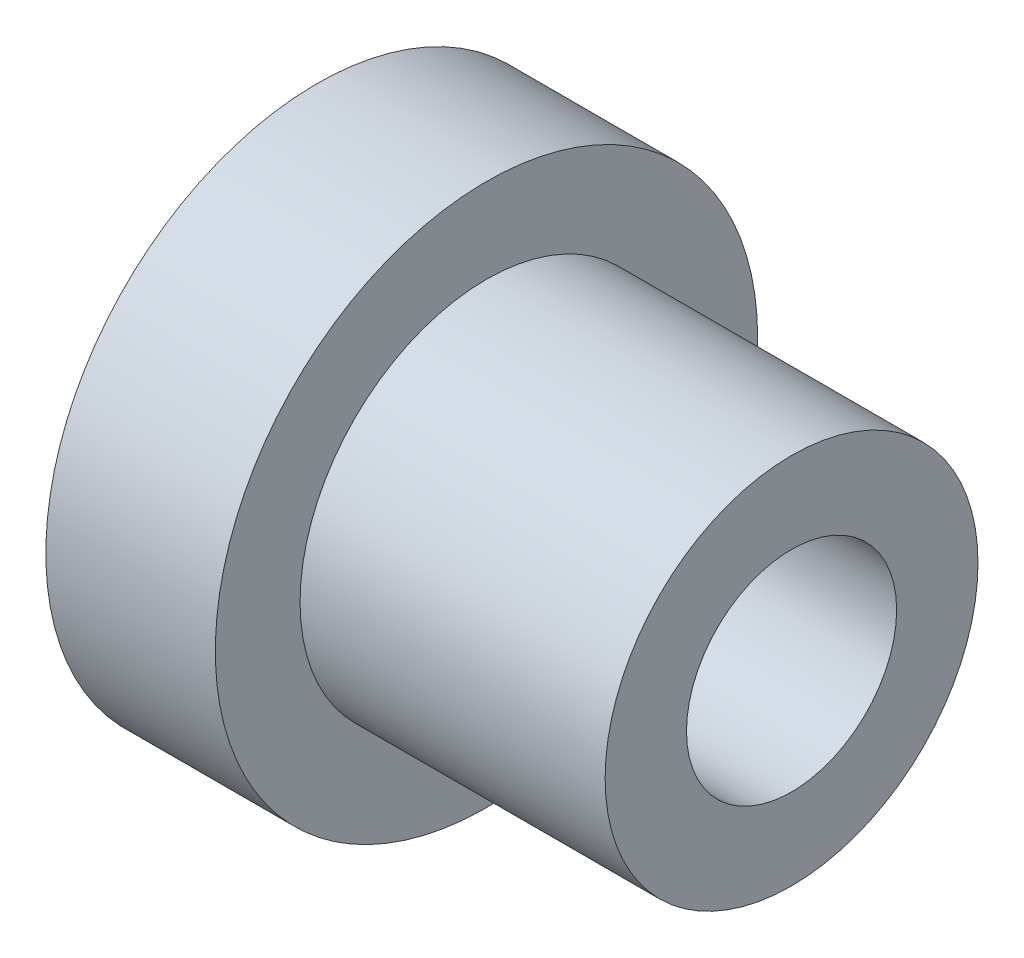
ISO-10303-21;
HEADER;
FILE_DESCRIPTION(('STEP AP214'),'2;1');
FILE_NAME('part.step','',(''),(''),'','','');
FILE_SCHEMA(('AUTOMOTIVE_DESIGN { 1 0 10303 214 1 1 1 1 }'));
ENDSEC;
DATA;
#1=APPLICATION_CONTEXT('core data for automotive mechanical design processes');
#2=APPLICATION_PROTOCOL_DEFINITION('international standard','automotive_design',2000,#1);
#3=PRODUCT_CONTEXT('',#1,'mechanical');
#4=PRODUCT('Part','Part','',(#3));
#5=PRODUCT_RELATED_PRODUCT_CATEGORY('part','',(#4));
#6=PRODUCT_DEFINITION_FORMATION('','',#4);
#7=PRODUCT_DEFINITION_CONTEXT('part definition',#1,'design');
#8=PRODUCT_DEFINITION('design','',#6,#7);
#9=PRODUCT_DEFINITION_SHAPE('','',#8);
#10=(LENGTH_UNIT() NAMED_UNIT(*) SI_UNIT(.MILLI.,.METRE.));
#11=(NAMED_UNIT(*) PLANE_ANGLE_UNIT() SI_UNIT($,.RADIAN.));
#12=(NAMED_UNIT(*) SI_UNIT($,.STERADIAN.) SOLID_ANGLE_UNIT());
#13=UNCERTAINTY_MEASURE_WITH_UNIT(LENGTH_MEASURE(1.E-05),#10,'distance_accuracy_value','');
#14=(GEOMETRIC_REPRESENTATION_CONTEXT(3) GLOBAL_UNCERTAINTY_ASSIGNED_CONTEXT((#13)) GLOBAL_UNIT_ASSIGNED_CONTEXT((#10,
#11,#12)) REPRESENTATION_CONTEXT('',''));
#15=CARTESIAN_POINT('',(0.,0.,0.));
#16=DIRECTION('',(0.,0.,1.));
#17=DIRECTION('',(1.,0.,0.));
#18=AXIS2_PLACEMENT_3D('',#15,#16,#17);
#19=CARTESIAN_POINT('',(-7.85,0.,0.));
#20=DIRECTION('',(1.,0.,0.));
#21=DIRECTION('',(0.,0.,-1.));
#22=AXIS2_PLACEMENT_3D('',#19,#20,#21);
#23=CYLINDRICAL_SURFACE('',#22,5.5);
#24=CARTESIAN_POINT('',(-2.85,0.,0.));
#25=DIRECTION('',(1.,0.,0.));
#26=DIRECTION('',(0.,0.,-1.));
#27=AXIS2_PLACEMENT_3D('',#24,#25,#26);
#28=CIRCLE('',#27,5.5);
#29=CARTESIAN_POINT('',(-2.85,0.,-5.5));
#30=VERTEX_POINT('',#29);
#31=EDGE_CURVE('E58',#30,#30,#28,.T.);
#32=ORIENTED_EDGE('',*,*,#31,.T.);
#33=EDGE_LOOP('',(#32));
#34=FACE_BOUND('',#33,.T.);
#35=CARTESIAN_POINT('',(6.15,0.,0.));
#36=DIRECTION('',(1.,0.,0.));
#37=DIRECTION('',(0.,0.,-1.));
#38=AXIS2_PLACEMENT_3D('',#35,#36,#37);
#39=CIRCLE('',#38,5.5);
#40=CARTESIAN_POINT('',(6.15,0.,-5.5));
#41=VERTEX_POINT('',#40);
#42=EDGE_CURVE('E10',#41,#41,#39,.T.);
#43=ORIENTED_EDGE('',*,*,#42,.F.);
#44=EDGE_LOOP('',(#43));
#45=FACE_BOUND('',#44,.T.);
#46=ADVANCED_FACE('F30',(#34,#45),#23,.T.);
#47=CARTESIAN_POINT('',(6.15,3.1,0.));
#48=DIRECTION('',(1.,0.,0.));
#49=DIRECTION('',(0.,0.,-1.));
#50=AXIS2_PLACEMENT_3D('',#47,#48,#49);
#51=PLANE('',#50);
#52=ORIENTED_EDGE('',*,*,#42,.T.);
#53=EDGE_LOOP('',(#52));
#54=FACE_BOUND('',#53,.T.);
#55=CARTESIAN_POINT('',(6.15,0.,0.));
#56=DIRECTION('',(1.,0.,0.));
#57=DIRECTION('',(0.,0.,-1.));
#58=AXIS2_PLACEMENT_3D('',#55,#56,#57);
#59=CIRCLE('',#58,3.1);
#60=CARTESIAN_POINT('',(6.15,0.,-3.1));
#61=VERTEX_POINT('',#60);
#62=EDGE_CURVE('E36',#61,#61,#59,.T.);
#63=ORIENTED_EDGE('',*,*,#62,.F.);
#64=EDGE_LOOP('',(#63));
#65=FACE_BOUND('',#64,.T.);
#66=ADVANCED_FACE('F76',(#54,#65),#51,.T.);
#67=CARTESIAN_POINT('',(-7.85,0.,0.));
#68=DIRECTION('',(1.,0.,0.));
#69=DIRECTION('',(0.,0.,-1.));
#70=AXIS2_PLACEMENT_3D('',#67,#68,#69);
#71=CYLINDRICAL_SURFACE('',#70,3.1);
#72=ORIENTED_EDGE('',*,*,#62,.T.);
#73=EDGE_LOOP('',(#72));
#74=FACE_BOUND('',#73,.T.);
#75=CARTESIAN_POINT('',(-5.35,0.,0.));
#76=DIRECTION('',(1.,0.,0.));
#77=DIRECTION('',(0.,0.,-1.));
#78=AXIS2_PLACEMENT_3D('',#75,#76,#77);
#79=CIRCLE('',#78,3.1);
#80=CARTESIAN_POINT('',(-5.35,0.,-3.1));
#81=VERTEX_POINT('',#80);
#82=EDGE_CURVE('E40',#81,#81,#79,.T.);
#83=ORIENTED_EDGE('',*,*,#82,.F.);
#84=EDGE_LOOP('',(#83));
#85=FACE_BOUND('',#84,.T.);
#86=ADVANCED_FACE('F80',(#74,#85),#71,.F.);
#87=CARTESIAN_POINT('',(-5.35,6.,0.));
#88=DIRECTION('',(-1.,0.,0.));
#89=DIRECTION('',(0.,0.,1.));
#90=AXIS2_PLACEMENT_3D('',#87,#88,#89);
#91=PLANE('',#90);
#92=ORIENTED_EDGE('',*,*,#82,.T.);
#93=EDGE_LOOP('',(#92));
#94=FACE_BOUND('',#93,.T.);
#95=CARTESIAN_POINT('',(-5.35,0.,0.));
#96=DIRECTION('',(1.,0.,0.));
#97=DIRECTION('',(0.,0.,-1.));
#98=AXIS2_PLACEMENT_3D('',#95,#96,#97);
#99=CIRCLE('',#98,6.);
#100=CARTESIAN_POINT('',(-5.35,0.,-6.));
#101=VERTEX_POINT('',#100);
#102=EDGE_CURVE('E44',#101,#101,#99,.T.);
#103=ORIENTED_EDGE('',*,*,#102,.F.);
#104=EDGE_LOOP('',(#103));
#105=FACE_BOUND('',#104,.T.);
#106=ADVANCED_FACE('F84',(#94,#105),#91,.T.);
#107=CARTESIAN_POINT('',(-7.85,0.,0.));
#108=DIRECTION('',(1.,0.,0.));
#109=DIRECTION('',(0.,0.,-1.));
#110=AXIS2_PLACEMENT_3D('',#107,#108,#109);
#111=CYLINDRICAL_SURFACE('',#110,6.);
#112=ORIENTED_EDGE('',*,*,#102,.T.);
#113=EDGE_LOOP('',(#112));
#114=FACE_BOUND('',#113,.T.);
#115=CARTESIAN_POINT('',(-7.85,0.,0.));
#116=DIRECTION('',(1.,0.,0.));
#117=DIRECTION('',(0.,0.,-1.));
#118=AXIS2_PLACEMENT_3D('',#115,#116,#117);
#119=CIRCLE('',#118,6.);
#120=CARTESIAN_POINT('',(-7.85,0.,-6.));
#121=VERTEX_POINT('',#120);
#122=EDGE_CURVE('E49',#121,#121,#119,.T.);
#123=ORIENTED_EDGE('',*,*,#122,.F.);
#124=EDGE_LOOP('',(#123));
#125=FACE_BOUND('',#124,.T.);
#126=ADVANCED_FACE('F90',(#114,#125),#111,.F.);
#127=CARTESIAN_POINT('',(-7.85,8.,0.));
#128=DIRECTION('',(-1.,0.,0.));
#129=DIRECTION('',(0.,0.,1.));
#130=AXIS2_PLACEMENT_3D('',#127,#128,#129);
#131=PLANE('',#130);
#132=ORIENTED_EDGE('',*,*,#122,.T.);
#133=EDGE_LOOP('',(#132));
#134=FACE_BOUND('',#133,.T.);
#135=CARTESIAN_POINT('',(-7.85,0.,0.));
#136=DIRECTION('',(1.,0.,0.));
#137=DIRECTION('',(0.,0.,-1.));
#138=AXIS2_PLACEMENT_3D('',#135,#136,#137);
#139=CIRCLE('',#138,8.);
#140=CARTESIAN_POINT('',(-7.85,0.,-8.));
#141=VERTEX_POINT('',#140);
#142=EDGE_CURVE('E52',#141,#141,#139,.T.);
#143=ORIENTED_EDGE('',*,*,#142,.F.);
#144=EDGE_LOOP('',(#143));
#145=FACE_BOUND('',#144,.T.);
#146=ADVANCED_FACE('F72',(#134,#145),#131,.T.);
#147=CARTESIAN_POINT('',(-7.85,0.,0.));
#148=DIRECTION('',(1.,0.,0.));
#149=DIRECTION('',(0.,0.,-1.));
#150=AXIS2_PLACEMENT_3D('',#147,#148,#149);
#151=CYLINDRICAL_SURFACE('',#150,8.);
#152=ORIENTED_EDGE('',*,*,#142,.T.);
#153=EDGE_LOOP('',(#152));
#154=FACE_BOUND('',#153,.T.);
#155=CARTESIAN_POINT('',(-2.85,0.,0.));
#156=DIRECTION('',(1.,0.,0.));
#157=DIRECTION('',(0.,0.,-1.));
#158=AXIS2_PLACEMENT_3D('',#155,#156,#157);
#159=CIRCLE('',#158,8.);
#160=CARTESIAN_POINT('',(-2.85,0.,-8.));
#161=VERTEX_POINT('',#160);
#162=EDGE_CURVE('E55',#161,#161,#159,.T.);
#163=ORIENTED_EDGE('',*,*,#162,.F.);
#164=EDGE_LOOP('',(#163));
#165=FACE_BOUND('',#164,.T.);
#166=ADVANCED_FACE('F66',(#154,#165),#151,.T.);
#167=CARTESIAN_POINT('',(-2.85,5.5,0.));
#168=DIRECTION('',(1.,0.,0.));
#169=DIRECTION('',(0.,0.,-1.));
#170=AXIS2_PLACEMENT_3D('',#167,#168,#169);
#171=PLANE('',#170);
#172=ORIENTED_EDGE('',*,*,#162,.T.);
#173=EDGE_LOOP('',(#172));
#174=FACE_BOUND('',#173,.T.);
#175=ORIENTED_EDGE('',*,*,#31,.F.);
#176=EDGE_LOOP('',(#175));
#177=FACE_BOUND('',#176,.T.);
#178=ADVANCED_FACE('F64',(#174,#177),#171,.T.);
#179=CLOSED_SHELL('',(#46,#66,#86,#106,#126,#146,#166,#178));
#180=MANIFOLD_SOLID_BREP('B2',#179);
#181=ADVANCED_BREP_SHAPE_REPRESENTATION('',(#18,#180),#14);
#182=SHAPE_DEFINITION_REPRESENTATION(#9,#181);
ENDSEC;
END-ISO-10303-21;
